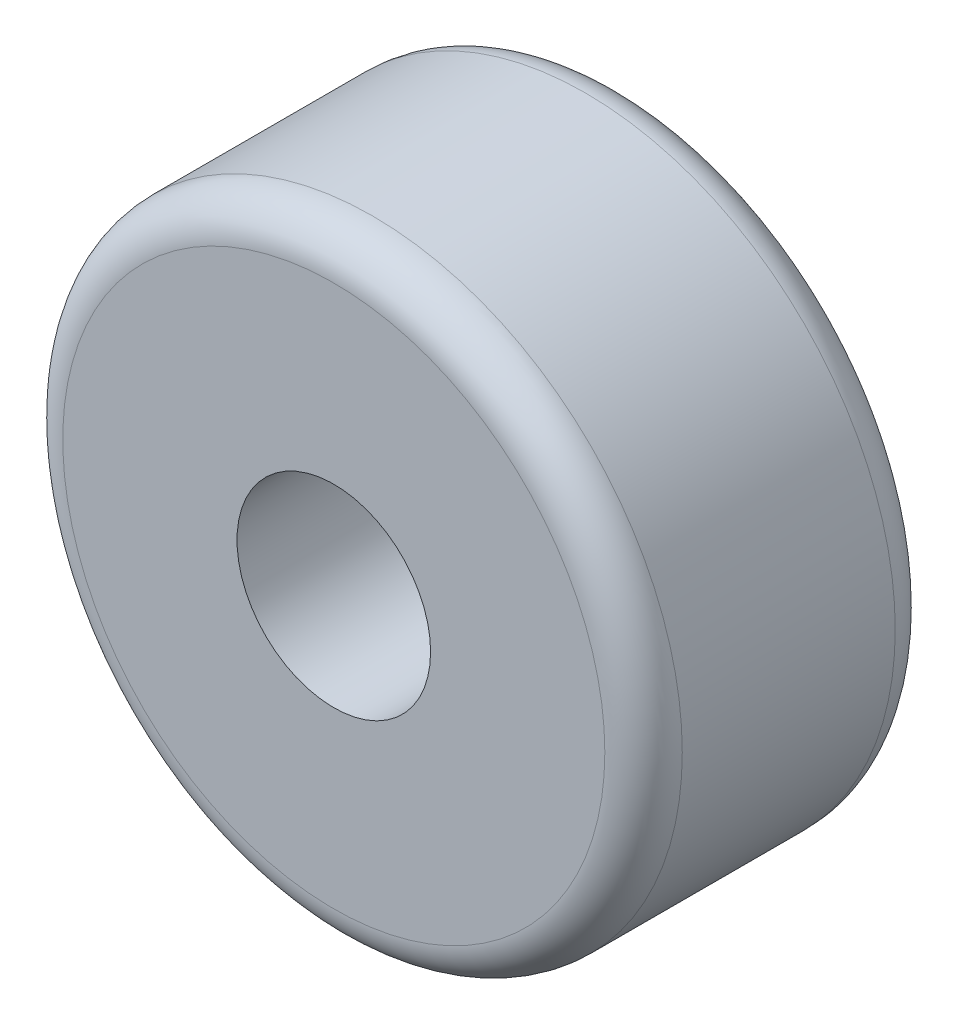
ISO-10303-21;
HEADER;
FILE_DESCRIPTION(('STEP AP214'),'2;1');
FILE_NAME('part.step','',(''),(''),'','','');
FILE_SCHEMA(('AUTOMOTIVE_DESIGN { 1 0 10303 214 1 1 1 1 }'));
ENDSEC;
DATA;
#1=APPLICATION_CONTEXT('core data for automotive mechanical design processes');
#2=APPLICATION_PROTOCOL_DEFINITION('international standard','automotive_design',2000,#1);
#3=PRODUCT_CONTEXT('',#1,'mechanical');
#4=PRODUCT('Part','Part','',(#3));
#5=PRODUCT_RELATED_PRODUCT_CATEGORY('part','',(#4));
#6=PRODUCT_DEFINITION_FORMATION('','',#4);
#7=PRODUCT_DEFINITION_CONTEXT('part definition',#1,'design');
#8=PRODUCT_DEFINITION('design','',#6,#7);
#9=PRODUCT_DEFINITION_SHAPE('','',#8);
#10=(LENGTH_UNIT() NAMED_UNIT(*) SI_UNIT(.MILLI.,.METRE.));
#11=(NAMED_UNIT(*) PLANE_ANGLE_UNIT() SI_UNIT($,.RADIAN.));
#12=(NAMED_UNIT(*) SI_UNIT($,.STERADIAN.) SOLID_ANGLE_UNIT());
#13=UNCERTAINTY_MEASURE_WITH_UNIT(LENGTH_MEASURE(1.E-05),#10,'distance_accuracy_value','');
#14=(GEOMETRIC_REPRESENTATION_CONTEXT(3) GLOBAL_UNCERTAINTY_ASSIGNED_CONTEXT((#13)) GLOBAL_UNIT_ASSIGNED_CONTEXT((#10,
#11,#12)) REPRESENTATION_CONTEXT('',''));
#15=CARTESIAN_POINT('',(0.,0.,0.));
#16=DIRECTION('',(0.,0.,1.));
#17=DIRECTION('',(1.,0.,0.));
#18=AXIS2_PLACEMENT_3D('',#15,#16,#17);
#19=CARTESIAN_POINT('',(0.,0.,75.));
#20=DIRECTION('',(0.,0.,-1.));
#21=DIRECTION('',(-1.,0.,0.));
#22=AXIS2_PLACEMENT_3D('',#19,#20,#21);
#23=CYLINDRICAL_SURFACE('',#22,25.);
#24=CARTESIAN_POINT('',(0.,0.,75.));
#25=DIRECTION('',(0.,0.,1.));
#26=DIRECTION('',(1.,0.,0.));
#27=AXIS2_PLACEMENT_3D('',#24,#25,#26);
#28=CIRCLE('',#27,25.);
#29=CARTESIAN_POINT('',(25.,0.,75.));
#30=VERTEX_POINT('',#29);
#31=EDGE_CURVE('E53',#30,#30,#28,.T.);
#32=ORIENTED_EDGE('',*,*,#31,.T.);
#33=EDGE_LOOP('',(#32));
#34=FACE_BOUND('',#33,.T.);
#35=CARTESIAN_POINT('',(0.,0.,0.));
#36=DIRECTION('',(0.,0.,1.));
#37=DIRECTION('',(1.,0.,0.));
#38=AXIS2_PLACEMENT_3D('',#35,#36,#37);
#39=CIRCLE('',#38,25.);
#40=CARTESIAN_POINT('',(25.,0.,0.));
#41=VERTEX_POINT('',#40);
#42=EDGE_CURVE('E54',#41,#41,#39,.T.);
#43=ORIENTED_EDGE('',*,*,#42,.F.);
#44=EDGE_LOOP('',(#43));
#45=FACE_BOUND('',#44,.T.);
#46=ADVANCED_FACE('F33',(#34,#45),#23,.F.);
#47=CARTESIAN_POINT('',(0.,0.,75.));
#48=DIRECTION('',(0.,0.,-1.));
#49=DIRECTION('',(-1.,0.,0.));
#50=AXIS2_PLACEMENT_3D('',#47,#48,#49);
#51=CYLINDRICAL_SURFACE('',#50,80.);
#52=CARTESIAN_POINT('',(0.,0.,9.99999999999999));
#53=DIRECTION('',(0.,0.,1.));
#54=DIRECTION('',(1.,0.,0.));
#55=AXIS2_PLACEMENT_3D('',#52,#53,#54);
#56=CIRCLE('',#55,80.);
#57=CARTESIAN_POINT('',(80.,0.,9.99999999999999));
#58=VERTEX_POINT('',#57);
#59=EDGE_CURVE('E44',#58,#58,#56,.T.);
#60=ORIENTED_EDGE('',*,*,#59,.T.);
#61=EDGE_LOOP('',(#60));
#62=FACE_BOUND('',#61,.T.);
#63=CARTESIAN_POINT('',(0.,0.,65.));
#64=DIRECTION('',(0.,0.,1.));
#65=DIRECTION('',(1.,0.,0.));
#66=AXIS2_PLACEMENT_3D('',#63,#64,#65);
#67=CIRCLE('',#66,80.);
#68=CARTESIAN_POINT('',(80.,0.,65.));
#69=VERTEX_POINT('',#68);
#70=EDGE_CURVE('E48',#69,#69,#67,.F.);
#71=ORIENTED_EDGE('',*,*,#70,.T.);
#72=EDGE_LOOP('',(#71));
#73=FACE_BOUND('',#72,.T.);
#74=ADVANCED_FACE('F65',(#62,#73),#51,.T.);
#75=CARTESIAN_POINT('',(0.,0.,75.));
#76=DIRECTION('',(0.,0.,1.));
#77=DIRECTION('',(1.,0.,0.));
#78=AXIS2_PLACEMENT_3D('',#75,#76,#77);
#79=PLANE('',#78);
#80=CARTESIAN_POINT('',(0.,0.,75.));
#81=DIRECTION('',(0.,0.,1.));
#82=DIRECTION('',(1.,0.,0.));
#83=AXIS2_PLACEMENT_3D('',#80,#81,#82);
#84=CIRCLE('',#83,70.);
#85=CARTESIAN_POINT('',(70.,0.,75.));
#86=VERTEX_POINT('',#85);
#87=EDGE_CURVE('E10',#86,#86,#84,.T.);
#88=ORIENTED_EDGE('',*,*,#87,.T.);
#89=EDGE_LOOP('',(#88));
#90=FACE_BOUND('',#89,.T.);
#91=ORIENTED_EDGE('',*,*,#31,.F.);
#92=EDGE_LOOP('',(#91));
#93=FACE_BOUND('',#92,.T.);
#94=ADVANCED_FACE('F62',(#90,#93),#79,.T.);
#95=CARTESIAN_POINT('',(0.,0.,0.));
#96=DIRECTION('',(0.,0.,1.));
#97=DIRECTION('',(1.,0.,0.));
#98=AXIS2_PLACEMENT_3D('',#95,#96,#97);
#99=PLANE('',#98);
#100=CARTESIAN_POINT('',(0.,0.,0.));
#101=DIRECTION('',(0.,0.,1.));
#102=DIRECTION('',(1.,0.,0.));
#103=AXIS2_PLACEMENT_3D('',#100,#101,#102);
#104=CIRCLE('',#103,70.);
#105=CARTESIAN_POINT('',(70.,0.,0.));
#106=VERTEX_POINT('',#105);
#107=EDGE_CURVE('E40',#106,#106,#104,.F.);
#108=ORIENTED_EDGE('',*,*,#107,.T.);
#109=EDGE_LOOP('',(#108));
#110=FACE_BOUND('',#109,.T.);
#111=ORIENTED_EDGE('',*,*,#42,.T.);
#112=EDGE_LOOP('',(#111));
#113=FACE_BOUND('',#112,.T.);
#114=ADVANCED_FACE('F64',(#110,#113),#99,.F.);
#115=CARTESIAN_POINT('',(0.,0.,9.99999999999999));
#116=DIRECTION('',(0.,0.,1.));
#117=DIRECTION('',(1.,0.,0.));
#118=AXIS2_PLACEMENT_3D('',#115,#116,#117);
#119=TOROIDAL_SURFACE('',#118,70.,10.);
#120=ORIENTED_EDGE('',*,*,#107,.F.);
#121=EDGE_LOOP('',(#120));
#122=FACE_BOUND('',#121,.T.);
#123=ORIENTED_EDGE('',*,*,#59,.F.);
#124=EDGE_LOOP('',(#123));
#125=FACE_BOUND('',#124,.T.);
#126=ADVANCED_FACE('F71',(#122,#125),#119,.T.);
#127=CARTESIAN_POINT('',(0.,0.,65.));
#128=DIRECTION('',(0.,0.,1.));
#129=DIRECTION('',(1.,0.,0.));
#130=AXIS2_PLACEMENT_3D('',#127,#128,#129);
#131=TOROIDAL_SURFACE('',#130,70.,10.);
#132=ORIENTED_EDGE('',*,*,#70,.F.);
#133=EDGE_LOOP('',(#132));
#134=FACE_BOUND('',#133,.T.);
#135=ORIENTED_EDGE('',*,*,#87,.F.);
#136=EDGE_LOOP('',(#135));
#137=FACE_BOUND('',#136,.T.);
#138=ADVANCED_FACE('F35',(#134,#137),#131,.T.);
#139=CLOSED_SHELL('',(#46,#74,#94,#114,#126,#138));
#140=MANIFOLD_SOLID_BREP('B2',#139);
#141=ADVANCED_BREP_SHAPE_REPRESENTATION('',(#18,#140),#14);
#142=SHAPE_DEFINITION_REPRESENTATION(#9,#141);
ENDSEC;
END-ISO-10303-21;
